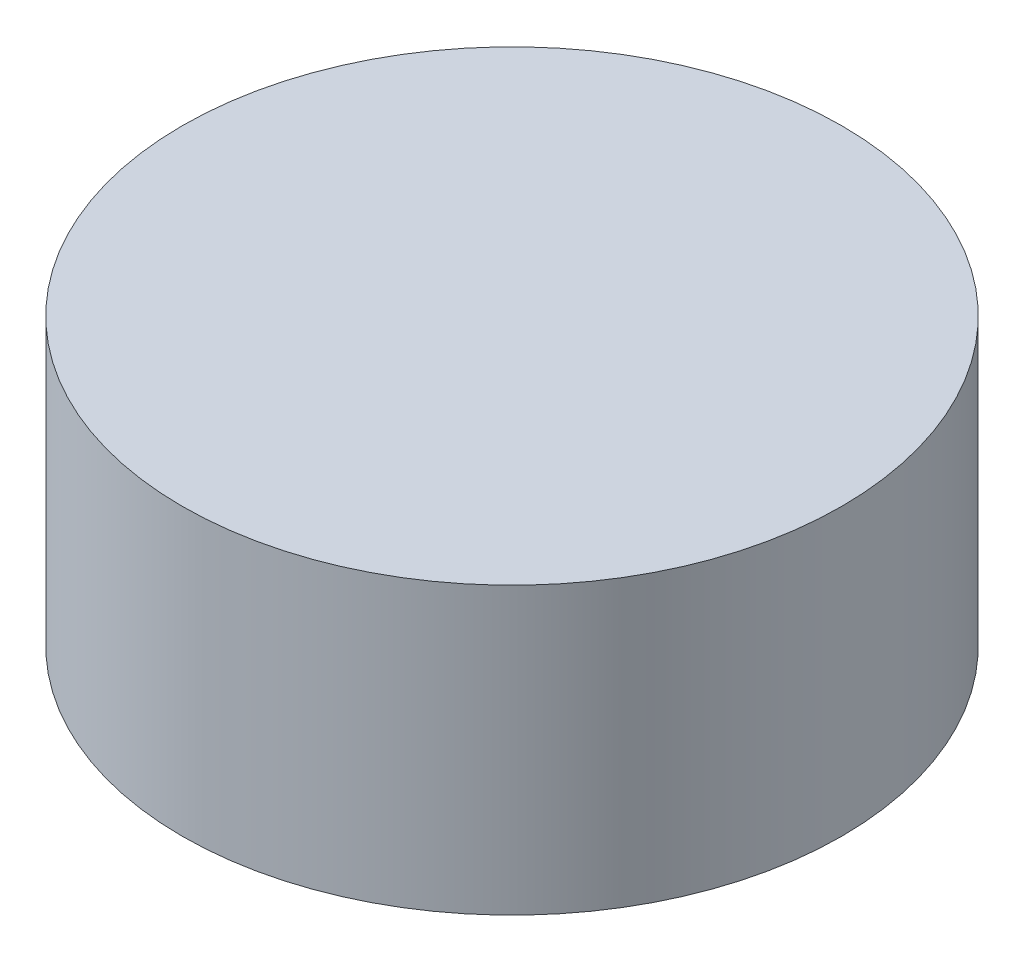
ISO-10303-21;
HEADER;
FILE_DESCRIPTION(('STEP AP214'),'2;1');
FILE_NAME('part.step','',(''),(''),'','','');
FILE_SCHEMA(('AUTOMOTIVE_DESIGN { 1 0 10303 214 1 1 1 1 }'));
ENDSEC;
DATA;
#1=APPLICATION_CONTEXT('core data for automotive mechanical design processes');
#2=APPLICATION_PROTOCOL_DEFINITION('international standard','automotive_design',2000,#1);
#3=PRODUCT_CONTEXT('',#1,'mechanical');
#4=PRODUCT('Part','Part','',(#3));
#5=PRODUCT_RELATED_PRODUCT_CATEGORY('part','',(#4));
#6=PRODUCT_DEFINITION_FORMATION('','',#4);
#7=PRODUCT_DEFINITION_CONTEXT('part definition',#1,'design');
#8=PRODUCT_DEFINITION('design','',#6,#7);
#9=PRODUCT_DEFINITION_SHAPE('','',#8);
#10=(LENGTH_UNIT() NAMED_UNIT(*) SI_UNIT(.MILLI.,.METRE.));
#11=(NAMED_UNIT(*) PLANE_ANGLE_UNIT() SI_UNIT($,.RADIAN.));
#12=(NAMED_UNIT(*) SI_UNIT($,.STERADIAN.) SOLID_ANGLE_UNIT());
#13=UNCERTAINTY_MEASURE_WITH_UNIT(LENGTH_MEASURE(1.E-05),#10,'distance_accuracy_value','');
#14=(GEOMETRIC_REPRESENTATION_CONTEXT(3) GLOBAL_UNCERTAINTY_ASSIGNED_CONTEXT((#13)) GLOBAL_UNIT_ASSIGNED_CONTEXT((#10,
#11,#12)) REPRESENTATION_CONTEXT('',''));
#15=CARTESIAN_POINT('',(0.,0.,0.));
#16=DIRECTION('',(0.,0.,1.));
#17=DIRECTION('',(1.,0.,0.));
#18=AXIS2_PLACEMENT_3D('',#15,#16,#17);
#19=CARTESIAN_POINT('',(0.,1300.,0.));
#20=DIRECTION('',(0.,-1.,0.));
#21=DIRECTION('',(0.,0.,-1.));
#22=AXIS2_PLACEMENT_3D('',#19,#20,#21);
#23=CYLINDRICAL_SURFACE('',#22,1500.);
#24=CARTESIAN_POINT('',(0.,1300.,0.));
#25=DIRECTION('',(0.,1.,0.));
#26=DIRECTION('',(0.,0.,1.));
#27=AXIS2_PLACEMENT_3D('',#24,#25,#26);
#28=CIRCLE('',#27,1500.);
#29=CARTESIAN_POINT('',(0.,1300.,1500.));
#30=VERTEX_POINT('',#29);
#31=EDGE_CURVE('E10',#30,#30,#28,.T.);
#32=ORIENTED_EDGE('',*,*,#31,.F.);
#33=EDGE_LOOP('',(#32));
#34=FACE_BOUND('',#33,.T.);
#35=CARTESIAN_POINT('',(0.,0.,0.));
#36=DIRECTION('',(0.,1.,0.));
#37=DIRECTION('',(0.,0.,1.));
#38=AXIS2_PLACEMENT_3D('',#35,#36,#37);
#39=CIRCLE('',#38,1500.);
#40=CARTESIAN_POINT('',(0.,0.,1500.));
#41=VERTEX_POINT('',#40);
#42=EDGE_CURVE('E38',#41,#41,#39,.T.);
#43=ORIENTED_EDGE('',*,*,#42,.T.);
#44=EDGE_LOOP('',(#43));
#45=FACE_BOUND('',#44,.T.);
#46=ADVANCED_FACE('F35',(#34,#45),#23,.T.);
#47=CARTESIAN_POINT('',(0.,1300.,0.));
#48=DIRECTION('',(0.,1.,0.));
#49=DIRECTION('',(0.,0.,1.));
#50=AXIS2_PLACEMENT_3D('',#47,#48,#49);
#51=PLANE('',#50);
#52=ORIENTED_EDGE('',*,*,#31,.T.);
#53=EDGE_LOOP('',(#52));
#54=FACE_BOUND('',#53,.T.);
#55=ADVANCED_FACE('F66',(#54),#51,.T.);
#56=CARTESIAN_POINT('',(0.,0.,0.));
#57=DIRECTION('',(0.,1.,0.));
#58=DIRECTION('',(0.,0.,1.));
#59=AXIS2_PLACEMENT_3D('',#56,#57,#58);
#60=PLANE('',#59);
#61=CARTESIAN_POINT('',(0.,0.,0.));
#62=DIRECTION('',(0.,1.,0.));
#63=DIRECTION('',(0.,0.,1.));
#64=AXIS2_PLACEMENT_3D('',#61,#62,#63);
#65=CIRCLE('',#64,1400.);
#66=CARTESIAN_POINT('',(0.,0.,1400.));
#67=VERTEX_POINT('',#66);
#68=EDGE_CURVE('E47',#67,#67,#65,.T.);
#69=ORIENTED_EDGE('',*,*,#68,.T.);
#70=EDGE_LOOP('',(#69));
#71=FACE_BOUND('',#70,.T.);
#72=ORIENTED_EDGE('',*,*,#42,.F.);
#73=EDGE_LOOP('',(#72));
#74=FACE_BOUND('',#73,.T.);
#75=ADVANCED_FACE('F62',(#71,#74),#60,.F.);
#76=CARTESIAN_POINT('',(0.,1300.,0.));
#77=DIRECTION('',(0.,-1.,0.));
#78=DIRECTION('',(0.,0.,-1.));
#79=AXIS2_PLACEMENT_3D('',#76,#77,#78);
#80=CYLINDRICAL_SURFACE('',#79,1400.);
#81=CARTESIAN_POINT('',(0.,1200.,0.));
#82=DIRECTION('',(0.,1.,0.));
#83=DIRECTION('',(0.,0.,1.));
#84=AXIS2_PLACEMENT_3D('',#81,#82,#83);
#85=CIRCLE('',#84,1400.);
#86=CARTESIAN_POINT('',(0.,1200.,1400.));
#87=VERTEX_POINT('',#86);
#88=EDGE_CURVE('E45',#87,#87,#85,.T.);
#89=ORIENTED_EDGE('',*,*,#88,.T.);
#90=EDGE_LOOP('',(#89));
#91=FACE_BOUND('',#90,.T.);
#92=ORIENTED_EDGE('',*,*,#68,.F.);
#93=EDGE_LOOP('',(#92));
#94=FACE_BOUND('',#93,.T.);
#95=ADVANCED_FACE('F53',(#91,#94),#80,.F.);
#96=CARTESIAN_POINT('',(0.,1200.,0.));
#97=DIRECTION('',(0.,1.,0.));
#98=DIRECTION('',(0.,0.,1.));
#99=AXIS2_PLACEMENT_3D('',#96,#97,#98);
#100=PLANE('',#99);
#101=ORIENTED_EDGE('',*,*,#88,.F.);
#102=EDGE_LOOP('',(#101));
#103=FACE_BOUND('',#102,.T.);
#104=ADVANCED_FACE('F56',(#103),#100,.F.);
#105=CLOSED_SHELL('',(#46,#55,#75,#95,#104));
#106=MANIFOLD_SOLID_BREP('B2',#105);
#107=ADVANCED_BREP_SHAPE_REPRESENTATION('',(#18,#106),#14);
#108=SHAPE_DEFINITION_REPRESENTATION(#9,#107);
ENDSEC;
END-ISO-10303-21;
